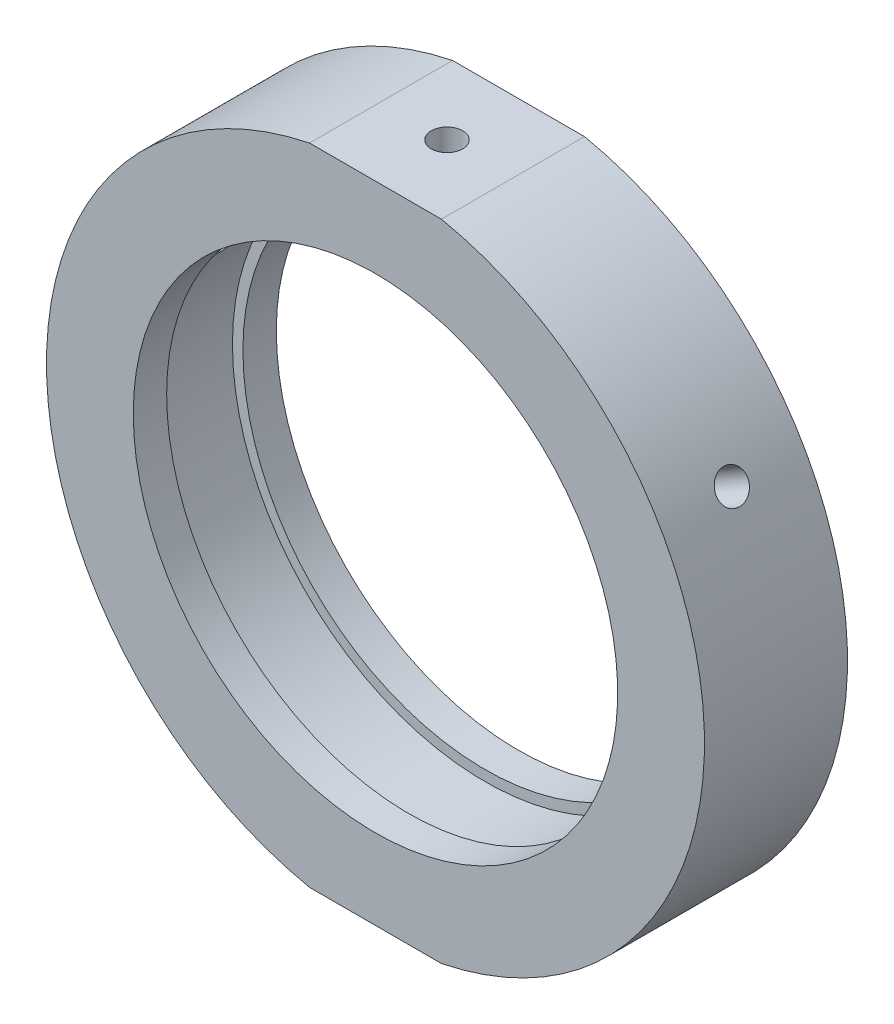
ISO-10303-21;
HEADER;
FILE_DESCRIPTION(('STEP AP214'),'2;1');
FILE_NAME('part.step','',(''),(''),'','','');
FILE_SCHEMA(('AUTOMOTIVE_DESIGN { 1 0 10303 214 1 1 1 1 }'));
ENDSEC;
DATA;
#1=APPLICATION_CONTEXT('core data for automotive mechanical design processes');
#2=APPLICATION_PROTOCOL_DEFINITION('international standard','automotive_design',2000,#1);
#3=PRODUCT_CONTEXT('',#1,'mechanical');
#4=PRODUCT('Part','Part','',(#3));
#5=PRODUCT_RELATED_PRODUCT_CATEGORY('part','',(#4));
#6=PRODUCT_DEFINITION_FORMATION('','',#4);
#7=PRODUCT_DEFINITION_CONTEXT('part definition',#1,'design');
#8=PRODUCT_DEFINITION('design','',#6,#7);
#9=PRODUCT_DEFINITION_SHAPE('','',#8);
#10=(LENGTH_UNIT() NAMED_UNIT(*) SI_UNIT(.MILLI.,.METRE.));
#11=(NAMED_UNIT(*) PLANE_ANGLE_UNIT() SI_UNIT($,.RADIAN.));
#12=(NAMED_UNIT(*) SI_UNIT($,.STERADIAN.) SOLID_ANGLE_UNIT());
#13=UNCERTAINTY_MEASURE_WITH_UNIT(LENGTH_MEASURE(1.E-05),#10,'distance_accuracy_value','');
#14=(GEOMETRIC_REPRESENTATION_CONTEXT(3) GLOBAL_UNCERTAINTY_ASSIGNED_CONTEXT((#13)) GLOBAL_UNIT_ASSIGNED_CONTEXT((#10,
#11,#12)) REPRESENTATION_CONTEXT('',''));
#15=CARTESIAN_POINT('',(0.,0.,0.));
#16=DIRECTION('',(0.,0.,1.));
#17=DIRECTION('',(1.,0.,0.));
#18=AXIS2_PLACEMENT_3D('',#15,#16,#17);
#19=CARTESIAN_POINT('',(0.,0.,-31.9390681003584));
#20=DIRECTION('',(0.,0.,-1.));
#21=DIRECTION('',(-1.,0.,0.));
#22=AXIS2_PLACEMENT_3D('',#19,#20,#21);
#23=CYLINDRICAL_SURFACE('',#22,34.5);
#24=CARTESIAN_POINT('',(29.018686518257,18.659202361171,0.));
#25=CARTESIAN_POINT('',(29.0186890226301,18.6591990847709,-0.0926243427230529));
#26=CARTESIAN_POINT('',(29.0229261660724,18.6526139808489,-0.185314497676535));
#27=CARTESIAN_POINT('',(29.0397421064565,18.6264223952989,-0.368138169659676));
#28=CARTESIAN_POINT('',(29.0523307499622,18.6068005430772,-0.458268537692519));
#29=CARTESIAN_POINT('',(29.0854084283758,18.5550519839002,-0.633297772029714));
#30=CARTESIAN_POINT('',(29.1058934574305,18.5229316173901,-0.718199265666094));
#31=CARTESIAN_POINT('',(29.154053713866,18.4470366758545,-0.880385338206471));
#32=CARTESIAN_POINT('',(29.1817272362996,18.4032648642265,-0.95767171725549));
#33=CARTESIAN_POINT('',(29.2433561506523,18.3051760072346,-1.1025293223219));
#34=CARTESIAN_POINT('',(29.277316671254,18.2508503506647,-1.1700925360107));
#35=CARTESIAN_POINT('',(29.3503804278457,18.1331177240746,-1.29351769255678));
#36=CARTESIAN_POINT('',(29.3894838729624,18.0697103847566,-1.3493791593463));
#37=CARTESIAN_POINT('',(29.4715871030045,17.9354881781567,-1.44783646516307));
#38=CARTESIAN_POINT('',(29.5145886771053,17.8646699070562,-1.4904261724723));
#39=CARTESIAN_POINT('',(29.6031190902553,17.7175816846396,-1.56109160826911));
#40=CARTESIAN_POINT('',(29.648647911373,17.6413117720034,-1.58916743972261));
#41=CARTESIAN_POINT('',(29.740808795372,17.4854932647401,-1.62998728862952));
#42=CARTESIAN_POINT('',(29.7874399787981,17.4059472484999,-1.6427431335627));
#43=CARTESIAN_POINT('',(29.8804691897067,17.2457571173625,-1.65259741342718));
#44=CARTESIAN_POINT('',(29.9268672189013,17.1651130105453,-1.6496959635067));
#45=CARTESIAN_POINT('',(30.018083628711,17.0050913768857,-1.62832784342119));
#46=CARTESIAN_POINT('',(30.0629032703104,16.9257128680339,-1.60987390628149));
#47=CARTESIAN_POINT('',(30.1497956002202,16.770442620803,-1.557944385443));
#48=CARTESIAN_POINT('',(30.1918682777349,16.6945508961276,-1.52446874271179));
#49=CARTESIAN_POINT('',(30.2722021813879,16.5484360864251,-1.44343152976842));
#50=CARTESIAN_POINT('',(30.3104618277835,16.4782153531619,-1.39586415349125));
#51=CARTESIAN_POINT('',(30.3822123637559,16.3455458494187,-1.28799798254371));
#52=CARTESIAN_POINT('',(30.4157032226793,16.2830971288969,-1.22769910604258));
#53=CARTESIAN_POINT('',(30.4771623434601,16.1677722457299,-1.09600960458675));
#54=CARTESIAN_POINT('',(30.5051250414628,16.114905731566,-1.02460793293809));
#55=CARTESIAN_POINT('',(30.5548550638342,16.0204148604137,-0.872778498215204));
#56=CARTESIAN_POINT('',(30.5766223866588,15.9787905062275,-0.792350732891145));
#57=CARTESIAN_POINT('',(30.6134867225159,15.9080492118723,-0.624745495457385));
#58=CARTESIAN_POINT('',(30.6285835419517,15.8789326347149,-0.537567827532799));
#59=CARTESIAN_POINT('',(30.6517835414348,15.8341026999537,-0.358940446729577));
#60=CARTESIAN_POINT('',(30.6598867696106,15.8183892501122,-0.26749076325471));
#61=CARTESIAN_POINT('',(30.6689247152818,15.8008593470062,-0.0830122772694559));
#62=CARTESIAN_POINT('',(30.6698665258734,15.7990291429491,0.0100148712465103));
#63=CARTESIAN_POINT('',(30.664580676854,15.8092860027456,0.195092849541695));
#64=CARTESIAN_POINT('',(30.658353038901,15.821373024557,0.287143682269392));
#65=CARTESIAN_POINT('',(30.6388634170433,15.8590823818547,0.467612670778402));
#66=CARTESIAN_POINT('',(30.6256046953998,15.8846984401569,0.556032490783882));
#67=CARTESIAN_POINT('',(30.5923358095992,15.9486765040332,0.726780786594247));
#68=CARTESIAN_POINT('',(30.5723256097426,15.987038577004,0.809109230187154));
#69=CARTESIAN_POINT('',(30.5259682580852,16.0753769032314,0.965408887343573));
#70=CARTESIAN_POINT('',(30.4996161301641,16.1253622755297,1.03937347098153));
#71=CARTESIAN_POINT('',(30.4411712398855,16.2354231711368,1.17677914740038));
#72=CARTESIAN_POINT('',(30.4090784437665,16.2954987537871,1.24022017828687));
#73=CARTESIAN_POINT('',(30.3398679677335,16.4239986427153,1.35482978227289));
#74=CARTESIAN_POINT('',(30.3027462394544,16.4924296708247,1.40598837488637));
#75=CARTESIAN_POINT('',(30.2243987545537,16.6355753834692,1.494512673378));
#76=CARTESIAN_POINT('',(30.183173014658,16.7102900423948,1.53187843546654));
#77=CARTESIAN_POINT('',(30.0976849159111,16.8637798205434,1.59173893309679));
#78=CARTESIAN_POINT('',(30.0534238720324,16.9425531778004,1.61424006401769));
#79=CARTESIAN_POINT('',(29.963030084702,17.1019067894185,1.64375352134684));
#80=CARTESIAN_POINT('',(29.9168973506251,17.1824870347285,1.65076592532463));
#81=CARTESIAN_POINT('',(29.8240946146471,17.3430669653615,1.64910212014318));
#82=CARTESIAN_POINT('',(29.7774251953544,17.4230671501364,1.640441572862));
#83=CARTESIAN_POINT('',(29.6848591764854,17.5803146476675,1.6077100652785));
#84=CARTESIAN_POINT('',(29.638962578377,17.6575619551951,1.5836390757076));
#85=CARTESIAN_POINT('',(29.5493252013585,17.8071612173229,1.52077310447278));
#86=CARTESIAN_POINT('',(29.5055844419095,17.8795131277338,1.48197798991912));
#87=CARTESIAN_POINT('',(29.4216223362801,18.017343299041,1.39076788234282));
#88=CARTESIAN_POINT('',(29.3814008795705,18.0828217758211,1.33835331726557));
#89=CARTESIAN_POINT('',(29.3057307454963,18.2052007887114,1.22133661715551));
#90=CARTESIAN_POINT('',(29.2702863485369,18.2620936372031,1.15672367477513));
#91=CARTESIAN_POINT('',(29.2053717797418,18.3657292092485,1.01714936462466));
#92=CARTESIAN_POINT('',(29.1759030811655,18.4124694299568,0.942185452546655));
#93=CARTESIAN_POINT('',(29.1239205894126,18.4945835544808,0.783982153805299));
#94=CARTESIAN_POINT('',(29.1014132049216,18.5299469858563,0.700735234302688));
#95=CARTESIAN_POINT('',(29.0641845622712,18.5882862214062,0.528445560311791));
#96=CARTESIAN_POINT('',(29.0494540958738,18.6112766763966,0.439409801080956));
#97=CARTESIAN_POINT('',(29.0321614740973,18.6382333601077,0.291516338342964));
#98=CARTESIAN_POINT('',(29.0271160082175,18.6460874105114,0.233616851804285));
#99=CARTESIAN_POINT('',(29.0203777395267,18.6565729452599,0.117153687562115));
#100=CARTESIAN_POINT('',(29.0186849341027,18.659204433675,0.0585900103763134));
#101=CARTESIAN_POINT('',(29.018686518257,18.659202361171,0.));
#102=B_SPLINE_CURVE_WITH_KNOTS('',3,(#24,#25,#26,#27,#28,#29,#30,#31,#32,#33,#34,#35,#36,#37,
#38,#39,#40,#41,#42,#43,#44,#45,#46,#47,#48,#49,#50,#51,#52,#53,#54,#55,#56,#57,#58,#59,#60,#61,
#62,#63,#64,#65,#66,#67,#68,#69,#70,#71,#72,#73,#74,#75,#76,#77,#78,#79,#80,#81,#82,#83,#84,#85,
#86,#87,#88,#89,#90,#91,#92,#93,#94,#95,#96,#97,#98,#99,#100,#101),.UNSPECIFIED.,.T.,.F.,(4,2,2,
2,2,2,2,2,2,2,2,2,2,2,2,2,2,2,2,2,2,2,2,2,2,2,2,2,2,2,2,2,2,2,2,2,2,2,4),(0.,0.277659154077304,
0.555646256308949,0.833492520289484,1.11127294552115,1.38928097954157,1.66730032169979,
1.94544792246327,2.22359354993491,2.50152430248859,2.77945301106291,3.05715439655709,
3.33485687337424,3.61267392845925,3.89049276924681,4.16858981490657,4.44668692988451,
4.72479211549335,5.00289538721968,5.28072317291097,5.55855011932173,5.83624827305819,
6.11394789519312,6.3918661256273,6.6697859905833,6.94793092956791,7.22607473500655,
7.50409879340256,7.78212145941516,8.05986645258555,8.33761197326969,8.61536000075172,
8.89309930199183,9.17108583548282,9.44914082116977,9.72745103152107,10.0054309661759,
10.1810658470197,10.3567005909779),.UNSPECIFIED.);
#103=CARTESIAN_POINT('',(29.018686518257,18.659202361171,0.));
#104=VERTEX_POINT('',#103);
#105=EDGE_CURVE('E11',#104,#104,#102,.T.);
#106=ORIENTED_EDGE('',*,*,#105,.T.);
#107=EDGE_LOOP('',(#106));
#108=FACE_BOUND('',#107,.T.);
#109=CARTESIAN_POINT('',(0.,0.,7.50000000000001));
#110=DIRECTION('',(0.,0.,-1.));
#111=DIRECTION('',(-1.,0.,0.));
#112=AXIS2_PLACEMENT_3D('',#109,#110,#111);
#113=CIRCLE('',#112,34.5);
#114=CARTESIAN_POINT('',(6.91447756522504,33.8,7.5));
#115=VERTEX_POINT('',#114);
#116=CARTESIAN_POINT('',(6.91447756522504,-33.8,7.50000000000001));
#117=VERTEX_POINT('',#116);
#118=EDGE_CURVE('E146',#115,#117,#113,.T.);
#119=ORIENTED_EDGE('',*,*,#118,.T.);
#120=DIRECTION('',(0.,0.,-1.));
#121=VECTOR('',#120,1.);
#122=CARTESIAN_POINT('',(6.9144775652251,-33.8,-31.9390681003584));
#123=LINE('',#122,#121);
#124=CARTESIAN_POINT('',(6.91447756522509,-33.8,-7.5));
#125=VERTEX_POINT('',#124);
#126=EDGE_CURVE('E59',#117,#125,#123,.T.);
#127=ORIENTED_EDGE('',*,*,#126,.T.);
#128=CARTESIAN_POINT('',(0.,0.,-7.5));
#129=DIRECTION('',(0.,0.,-1.));
#130=DIRECTION('',(-1.,0.,0.));
#131=AXIS2_PLACEMENT_3D('',#128,#129,#130);
#132=CIRCLE('',#131,34.5);
#133=CARTESIAN_POINT('',(6.9144775652251,33.8,-7.49999999999999));
#134=VERTEX_POINT('',#133);
#135=EDGE_CURVE('E150',#134,#125,#132,.T.);
#136=ORIENTED_EDGE('',*,*,#135,.F.);
#137=DIRECTION('',(0.,0.,-1.));
#138=VECTOR('',#137,1.);
#139=CARTESIAN_POINT('',(6.9144775652251,33.8,-31.9390681003584));
#140=LINE('',#139,#138);
#141=EDGE_CURVE('E120',#134,#115,#140,.F.);
#142=ORIENTED_EDGE('',*,*,#141,.T.);
#143=EDGE_LOOP('',(#119,#127,#136,#142));
#144=FACE_BOUND('',#143,.T.);
#145=ADVANCED_FACE('F39',(#108,#144),#23,.T.);
#146=CARTESIAN_POINT('',(25.4,0.,-7.5));
#147=DIRECTION('',(0.,0.,1.));
#148=DIRECTION('',(1.,0.,0.));
#149=AXIS2_PLACEMENT_3D('',#146,#147,#148);
#150=PLANE('',#149);
#151=CARTESIAN_POINT('',(0.,0.,-7.5));
#152=DIRECTION('',(0.,0.,-1.));
#153=DIRECTION('',(-1.,0.,0.));
#154=AXIS2_PLACEMENT_3D('',#151,#152,#153);
#155=CIRCLE('',#154,25.4);
#156=CARTESIAN_POINT('',(-25.4,0.,-7.5));
#157=VERTEX_POINT('',#156);
#158=EDGE_CURVE('E128',#157,#157,#155,.T.);
#159=ORIENTED_EDGE('',*,*,#158,.F.);
#160=EDGE_LOOP('',(#159));
#161=FACE_BOUND('',#160,.T.);
#162=ORIENTED_EDGE('',*,*,#135,.T.);
#163=DIRECTION('',(-1.,0.,0.));
#164=VECTOR('',#163,1.);
#165=CARTESIAN_POINT('',(25.4,-33.8,-7.5));
#166=LINE('',#165,#164);
#167=CARTESIAN_POINT('',(-6.9144775652251,-33.8,-7.49999999999999));
#168=VERTEX_POINT('',#167);
#169=EDGE_CURVE('E116',#125,#168,#166,.T.);
#170=ORIENTED_EDGE('',*,*,#169,.T.);
#171=CARTESIAN_POINT('',(-6.91447756522508,33.8,-7.5));
#172=VERTEX_POINT('',#171);
#173=EDGE_CURVE('E149',#168,#172,#132,.T.);
#174=ORIENTED_EDGE('',*,*,#173,.T.);
#175=DIRECTION('',(1.,0.,0.));
#176=VECTOR('',#175,1.);
#177=CARTESIAN_POINT('',(25.4,33.8,-7.5));
#178=LINE('',#177,#176);
#179=EDGE_CURVE('E123',#172,#134,#178,.T.);
#180=ORIENTED_EDGE('',*,*,#179,.T.);
#181=EDGE_LOOP('',(#162,#170,#174,#180));
#182=FACE_BOUND('',#181,.T.);
#183=ADVANCED_FACE('F41',(#161,#182),#150,.F.);
#184=CARTESIAN_POINT('',(-30.668686518257,15.8013185286824,0.));
#185=CARTESIAN_POINT('',(-30.6686849329978,15.8013223357332,-0.0926243427230534));
#186=CARTESIAN_POINT('',(-30.665100637436,15.8082843615547,-0.185314497676536));
#187=CARTESIAN_POINT('',(-30.6508260291763,15.8359431858907,-0.368138169659677));
#188=CARTESIAN_POINT('',(-30.6401273284359,15.8566561970768,-0.45826853769252));
#189=CARTESIAN_POINT('',(-30.6118506007862,15.9111765864697,-0.633297772029714));
#190=CARTESIAN_POINT('',(-30.5942760619368,15.9449773252833,-0.718199265666095));
#191=CARTESIAN_POINT('',(-30.5526292427661,16.0246328015771,-0.880385338206472));
#192=CARTESIAN_POINT('',(-30.5285585031433,16.0704846808308,-0.957671717255491));
#193=CARTESIAN_POINT('',(-30.4744255183365,16.1729013147638,-1.1025293223219));
#194=CARTESIAN_POINT('',(-30.4443583799706,16.2294748166156,-1.1700925360107));
#195=CARTESIAN_POINT('',(-30.3789308127852,16.3516161992149,-1.29351769255678));
#196=CARTESIAN_POINT('',(-30.3435701687077,16.4171844457205,-1.3493791593463));
#197=CARTESIAN_POINT('',(-30.2683819430613,16.5553990319696,-1.44783646516308));
#198=CARTESIAN_POINT('',(-30.2285523082866,16.6280486230939,-1.4904261724723));
#199=CARTESIAN_POINT('',(-30.1454353776513,16.7782623210977,-1.56109160826912));
#200=CARTESIAN_POINT('',(-30.1021481063228,16.855826393108,-1.58916743972261));
#201=CARTESIAN_POINT('',(-30.0132857626524,17.013549313518,-1.62998728862952));
#202=CARTESIAN_POINT('',(-29.9677124835316,17.0937061110937,-1.6427431335627));
#203=CARTESIAN_POINT('',(-29.8754983659854,17.2543668366032,-1.65259741342718));
#204=CARTESIAN_POINT('',(-29.8288575354135,17.3348707619799,-1.6496959635067));
#205=CARTESIAN_POINT('',(-29.735882940414,17.493877306947,-1.62832784342119));
#206=CARTESIAN_POINT('',(-29.6895489560336,17.5723815095864,-1.60987390628149));
#207=CARTESIAN_POINT('',(-29.5985271424346,17.7252675982977,-1.557944385443));
#208=CARTESIAN_POINT('',(-29.553839319686,17.7996494681684,-1.52446874271179));
#209=CARTESIAN_POINT('',(-29.4674671344411,17.9422780743683,-1.44343152976842));
#210=CARTESIAN_POINT('',(-29.4257840187606,18.0105222667184,-1.39586415349125));
#211=CARTESIAN_POINT('',(-29.3467641261977,18.1389948054771,-1.28799798254371));
#212=CARTESIAN_POINT('',(-29.3094273772537,18.1992231003603,-1.22769910604258));
#213=CARTESIAN_POINT('',(-29.2402826591329,18.3101107018343,-1.09600960458675));
#214=CARTESIAN_POINT('',(-29.2084802638588,18.3607603657449,-1.02460793293809));
#215=CARTESIAN_POINT('',(-29.151513780201,18.4510732640255,-0.872778498215202));
#216=CARTESIAN_POINT('',(-29.1263496934718,18.490736495657,-0.792350732891143));
#217=CARTESIAN_POINT('',(-29.0835181033921,18.5580325941805,-0.624745495457382));
#218=CARTESIAN_POINT('',(-29.0658508176205,18.585665111907,-0.537567827532797));
#219=CARTESIAN_POINT('',(-29.0386269550089,18.6281718682077,-0.358940446729574));
#220=CARTESIAN_POINT('',(-29.0290703223529,18.6430461945814,-0.267490763254706));
#221=CARTESIAN_POINT('',(-29.0184079537728,18.6596382366837,-0.0830122772694523));
#222=CARTESIAN_POINT('',(-29.0172938558611,18.6613689706101,0.0100148712465135));
#223=CARTESIAN_POINT('',(-29.0235336324983,18.6516628611804,0.195092849541697));
#224=CARTESIAN_POINT('',(-29.0308874814665,18.6402260576018,0.287143682269394));
#225=CARTESIAN_POINT('',(-29.0537999319178,18.6044928713141,0.467612670778404));
#226=CARTESIAN_POINT('',(-29.0693547283306,18.5802024523981,0.556032490783885));
#227=CARTESIAN_POINT('',(-29.1081269140322,18.519401720201,0.72678078659425));
#228=CARTESIAN_POINT('',(-29.1313443438384,18.482891342305,0.809109230187156));
#229=CARTESIAN_POINT('',(-29.1846689026504,18.3985755350037,0.965408887343574));
#230=CARTESIAN_POINT('',(-29.2147814409179,18.3507612366312,1.03937347098153));
#231=CARTESIAN_POINT('',(-29.2808745273376,18.245116029125,1.17677914740039));
#232=CARTESIAN_POINT('',(-29.3168551100003,18.1872850610823,1.24022017828687));
#233=CARTESIAN_POINT('',(-29.3935340401792,18.0630970861656,1.35482978227289));
#234=CARTESIAN_POINT('',(-29.4342361847895,17.9967332123888,1.40598837488637));
#235=CARTESIAN_POINT('',(-29.519030265932,17.8573094438199,1.494512673378));
#236=CARTESIAN_POINT('',(-29.5631221886489,17.7842495763177,1.53187843546654));
#237=CARTESIAN_POINT('',(-29.6533041863734,17.6334698220073,1.59173893309679));
#238=CARTESIAN_POINT('',(-29.6993933929599,17.5557519549819,1.61424006401769));
#239=CARTESIAN_POINT('',(-29.7922007751408,17.3977918330003,1.64375352134684));
#240=CARTESIAN_POINT('',(-29.838918947584,17.3175495906887,1.65076592532463));
#241=CARTESIAN_POINT('',(-29.9315838788611,17.1568900984746,1.64910212014318));
#242=CARTESIAN_POINT('',(-29.9775313615373,17.0764731033998,1.640441572862));
#243=CARTESIAN_POINT('',(-30.0674286796463,16.9176848307665,1.6077100652785));
#244=CARTESIAN_POINT('',(-30.1113785112849,16.8393135570936,1.5836390757076));
#245=CARTESIAN_POINT('',(-30.1961165841658,16.686885680403,1.52077310447278));
#246=CARTESIAN_POINT('',(-30.2369047968694,16.6128291163339,1.48197798991912));
#247=CARTESIAN_POINT('',(-30.3142881738147,16.47120071425,1.39076788234282));
#248=CARTESIAN_POINT('',(-30.3508834697526,16.4036286725723,1.33835331726557));
#249=CARTESIAN_POINT('',(-30.4190317367686,16.276906907711,1.22133661715551));
#250=CARTESIAN_POINT('',(-30.4505801903763,16.2177647352765,1.15672367477513));
#251=CARTESIAN_POINT('',(-30.5078739441058,16.1097292836016,1.01714936462466));
#252=CARTESIAN_POINT('',(-30.5336178133295,16.0608385316639,0.942185452546655));
#253=CARTESIAN_POINT('',(-30.5787394853004,15.9747633109919,0.783982153805298));
#254=CARTESIAN_POINT('',(-30.5981114229911,15.9375896285622,0.700735234302687));
#255=CARTESIAN_POINT('',(-30.6300203616894,15.8761790605036,0.528445560311791));
#256=CARTESIAN_POINT('',(-30.642565446557,15.8519268748987,0.439409801080956));
#257=CARTESIAN_POINT('',(-30.6572643085643,15.8234726832866,0.291516338342964));
#258=CARTESIAN_POINT('',(-30.6615433827967,15.8151761564589,0.233616851804285));
#259=CARTESIAN_POINT('',(-30.6672549879157,15.8040978772209,0.117153687562115));
#260=CARTESIAN_POINT('',(-30.668687521021,15.8013161205126,0.0585900103763135));
#261=CARTESIAN_POINT('',(-30.668686518257,15.8013185286824,0.));
#262=B_SPLINE_CURVE_WITH_KNOTS('',3,(#184,#185,#186,#187,#188,#189,#190,#191,#192,#193,#194,
#195,#196,#197,#198,#199,#200,#201,#202,#203,#204,#205,#206,#207,#208,#209,#210,#211,#212,#213,
#214,#215,#216,#217,#218,#219,#220,#221,#222,#223,#224,#225,#226,#227,#228,#229,#230,#231,#232,
#233,#234,#235,#236,#237,#238,#239,#240,#241,#242,#243,#244,#245,#246,#247,#248,#249,#250,#251,
#252,#253,#254,#255,#256,#257,#258,#259,#260,#261),.UNSPECIFIED.,.T.,.F.,(4,2,2,2,2,2,2,2,2,2,2,
2,2,2,2,2,2,2,2,2,2,2,2,2,2,2,2,2,2,2,2,2,2,2,2,2,2,2,4),(0.,0.277659154077306,0.55564625630895,
0.833492520289485,1.11127294552115,1.38928097954157,1.6673003216998,1.94544792246328,
2.22359354993491,2.50152430248859,2.77945301106291,3.05715439655709,3.33485687337424,
3.61267392845925,3.89049276924681,4.16858981490657,4.44668692988451,4.72479211549335,
5.00289538721968,5.28072317291098,5.55855011932173,5.83624827305819,6.11394789519312,
6.39186612562731,6.6697859905833,6.94793092956791,7.22607473500655,7.50409879340256,
7.78212145941516,8.05986645258555,8.33761197326969,8.61536000075172,8.89309930199183,
9.17108583548282,9.44914082116977,9.72745103152107,10.0054309661759,10.1810658470197,
10.3567005909779),.UNSPECIFIED.);
#263=CARTESIAN_POINT('',(-30.668686518257,15.8013185286824,0.));
#264=VERTEX_POINT('',#263);
#265=EDGE_CURVE('E174',#264,#264,#262,.T.);
#266=ORIENTED_EDGE('',*,*,#265,.T.);
#267=EDGE_LOOP('',(#266));
#268=FACE_BOUND('',#267,.T.);
#269=ORIENTED_EDGE('',*,*,#173,.F.);
#270=DIRECTION('',(0.,0.,-1.));
#271=VECTOR('',#270,1.);
#272=CARTESIAN_POINT('',(-6.9144775652251,-33.8,-31.9390681003584));
#273=LINE('',#272,#271);
#274=CARTESIAN_POINT('',(-6.91447756522503,-33.8,7.5));
#275=VERTEX_POINT('',#274);
#276=EDGE_CURVE('E114',#168,#275,#273,.F.);
#277=ORIENTED_EDGE('',*,*,#276,.T.);
#278=CARTESIAN_POINT('',(-6.91447756522503,33.8,7.50000000000001));
#279=VERTEX_POINT('',#278);
#280=EDGE_CURVE('E67',#275,#279,#113,.T.);
#281=ORIENTED_EDGE('',*,*,#280,.T.);
#282=DIRECTION('',(0.,0.,-1.));
#283=VECTOR('',#282,1.);
#284=CARTESIAN_POINT('',(-6.9144775652251,33.8,-31.9390681003584));
#285=LINE('',#284,#283);
#286=EDGE_CURVE('E126',#279,#172,#285,.T.);
#287=ORIENTED_EDGE('',*,*,#286,.T.);
#288=EDGE_LOOP('',(#269,#277,#281,#287));
#289=FACE_BOUND('',#288,.T.);
#290=ADVANCED_FACE('F159',(#268,#289),#23,.T.);
#291=CARTESIAN_POINT('',(34.5,0.,7.5));
#292=DIRECTION('',(0.,0.,-1.));
#293=DIRECTION('',(-1.,0.,0.));
#294=AXIS2_PLACEMENT_3D('',#291,#292,#293);
#295=PLANE('',#294);
#296=ORIENTED_EDGE('',*,*,#280,.F.);
#297=DIRECTION('',(1.,0.,0.));
#298=VECTOR('',#297,1.);
#299=CARTESIAN_POINT('',(34.5,-33.8,7.5));
#300=LINE('',#299,#298);
#301=EDGE_CURVE('E52',#275,#117,#300,.T.);
#302=ORIENTED_EDGE('',*,*,#301,.T.);
#303=ORIENTED_EDGE('',*,*,#118,.F.);
#304=DIRECTION('',(-1.,0.,0.));
#305=VECTOR('',#304,1.);
#306=CARTESIAN_POINT('',(34.5,33.8,7.5));
#307=LINE('',#306,#305);
#308=EDGE_CURVE('E153',#115,#279,#307,.T.);
#309=ORIENTED_EDGE('',*,*,#308,.T.);
#310=EDGE_LOOP('',(#296,#302,#303,#309));
#311=FACE_BOUND('',#310,.T.);
#312=CARTESIAN_POINT('',(0.,0.,7.5));
#313=DIRECTION('',(0.,0.,-1.));
#314=DIRECTION('',(-1.,0.,0.));
#315=AXIS2_PLACEMENT_3D('',#312,#313,#314);
#316=CIRCLE('',#315,25.4);
#317=CARTESIAN_POINT('',(-25.4,0.,7.5));
#318=VERTEX_POINT('',#317);
#319=EDGE_CURVE('E143',#318,#318,#316,.T.);
#320=ORIENTED_EDGE('',*,*,#319,.T.);
#321=EDGE_LOOP('',(#320));
#322=FACE_BOUND('',#321,.T.);
#323=ADVANCED_FACE('F192',(#311,#322),#295,.F.);
#324=CARTESIAN_POINT('',(0.,0.,-31.9390681003584));
#325=DIRECTION('',(0.,0.,-1.));
#326=DIRECTION('',(-1.,0.,0.));
#327=AXIS2_PLACEMENT_3D('',#324,#325,#326);
#328=CYLINDRICAL_SURFACE('',#327,25.4);
#329=ORIENTED_EDGE('',*,*,#319,.F.);
#330=EDGE_LOOP('',(#329));
#331=FACE_BOUND('',#330,.T.);
#332=CARTESIAN_POINT('',(0.,0.,4.));
#333=DIRECTION('',(0.,0.,-1.));
#334=DIRECTION('',(-1.,0.,0.));
#335=AXIS2_PLACEMENT_3D('',#332,#333,#334);
#336=CIRCLE('',#335,25.4);
#337=CARTESIAN_POINT('',(-25.4,0.,4.));
#338=VERTEX_POINT('',#337);
#339=EDGE_CURVE('E140',#338,#338,#336,.T.);
#340=ORIENTED_EDGE('',*,*,#339,.T.);
#341=EDGE_LOOP('',(#340));
#342=FACE_BOUND('',#341,.T.);
#343=ADVANCED_FACE('F189',(#331,#342),#328,.F.);
#344=CARTESIAN_POINT('',(25.4,0.,4.));
#345=DIRECTION('',(0.,0.,1.));
#346=DIRECTION('',(1.,0.,0.));
#347=AXIS2_PLACEMENT_3D('',#344,#345,#346);
#348=PLANE('',#347);
#349=ORIENTED_EDGE('',*,*,#339,.F.);
#350=EDGE_LOOP('',(#349));
#351=FACE_BOUND('',#350,.T.);
#352=CARTESIAN_POINT('',(0.,0.,4.));
#353=DIRECTION('',(0.,0.,-1.));
#354=DIRECTION('',(-1.,0.,0.));
#355=AXIS2_PLACEMENT_3D('',#352,#353,#354);
#356=CIRCLE('',#355,26.5);
#357=CARTESIAN_POINT('',(-26.5,0.,4.));
#358=VERTEX_POINT('',#357);
#359=EDGE_CURVE('E137',#358,#358,#356,.T.);
#360=ORIENTED_EDGE('',*,*,#359,.T.);
#361=EDGE_LOOP('',(#360));
#362=FACE_BOUND('',#361,.T.);
#363=ADVANCED_FACE('F183',(#351,#362),#348,.F.);
#364=CARTESIAN_POINT('',(0.,0.,-31.9390681003584));
#365=DIRECTION('',(0.,0.,-1.));
#366=DIRECTION('',(-1.,0.,0.));
#367=AXIS2_PLACEMENT_3D('',#364,#365,#366);
#368=CYLINDRICAL_SURFACE('',#367,26.5);
#369=CARTESIAN_POINT('',(-23.7301440728933,11.7953491800679,0.));
#370=CARTESIAN_POINT('',(-23.7301426315556,11.7953530523703,0.092584794291166));
#371=CARTESIAN_POINT('',(-23.7266601850363,11.8023662019752,0.185234434036178));
#372=CARTESIAN_POINT('',(-23.7127829671561,11.8302221765848,0.367975476334141));
#373=CARTESIAN_POINT('',(-23.7023801480403,11.8510811028887,0.458063772945838));
#374=CARTESIAN_POINT('',(-23.6748577267139,11.9059669326837,0.633008646244693));
#375=CARTESIAN_POINT('',(-23.6577416673841,11.9399868903737,0.717867955216654));
#376=CARTESIAN_POINT('',(-23.6171248265298,12.0201257551922,0.879978001386831));
#377=CARTESIAN_POINT('',(-23.593625507895,12.0662418900844,0.957230476368432));
#378=CARTESIAN_POINT('',(-23.5406732430841,12.1692255333633,1.10207147063524));
#379=CARTESIAN_POINT('',(-23.5112125003349,12.226107114835,1.16964713451791));
#380=CARTESIAN_POINT('',(-23.4469742856686,12.3488535927227,1.29310627919576));
#381=CARTESIAN_POINT('',(-23.4121965921936,12.414718863478,1.34898927252584));
#382=CARTESIAN_POINT('',(-23.3380723141613,12.5535080894395,1.44751591371275));
#383=CARTESIAN_POINT('',(-23.2987221137364,12.6264376232677,1.49014898449409));
#384=CARTESIAN_POINT('',(-23.2164163184041,12.7771427669188,1.56089784694351));
#385=CARTESIAN_POINT('',(-23.1734607618567,12.8549183251792,1.58901379304684));
#386=CARTESIAN_POINT('',(-23.0851004064078,13.0129288729823,1.62989479118302));
#387=CARTESIAN_POINT('',(-23.0396988875959,13.0931605094179,1.64267989191114));
#388=CARTESIAN_POINT('',(-22.9476290832938,13.2538633471374,1.65259818878884));
#389=CARTESIAN_POINT('',(-22.9009608119979,13.3343345457279,1.64973156024638));
#390=CARTESIAN_POINT('',(-22.8077641476428,13.4931227056173,1.62844431441806));
#391=CARTESIAN_POINT('',(-22.7612356503593,13.5714424986272,1.61004526468086));
#392=CARTESIAN_POINT('',(-22.6696546839537,13.7238721805026,1.55824892569699));
#393=CARTESIAN_POINT('',(-22.6246022235062,13.7979820446288,1.52485154832424));
#394=CARTESIAN_POINT('',(-22.5373586689691,13.9400295705033,1.44398215830166));
#395=CARTESIAN_POINT('',(-22.495169587228,14.0079629026162,1.39650037061728));
#396=CARTESIAN_POINT('',(-22.4150636715141,14.1357921533411,1.28881710743124));
#397=CARTESIAN_POINT('',(-22.3771468852504,14.195687982199,1.22861548990751));
#398=CARTESIAN_POINT('',(-22.3068044837855,14.3059696905885,1.09707965852733));
#399=CARTESIAN_POINT('',(-22.2743882968895,14.3563392582196,1.02572672486742));
#400=CARTESIAN_POINT('',(-22.2162551565766,14.4461371128321,0.87397929945473));
#401=CARTESIAN_POINT('',(-22.1905382058045,14.4855653954942,0.793584804132692));
#402=CARTESIAN_POINT('',(-22.1467214540453,14.5524683853247,0.626024399450548));
#403=CARTESIAN_POINT('',(-22.128622078978,14.5799424241009,0.538858111783452));
#404=CARTESIAN_POINT('',(-22.1007034178629,14.6222281477467,0.36023393898428));
#405=CARTESIAN_POINT('',(-22.0908840351472,14.6370399804462,0.268776103968693));
#406=CARTESIAN_POINT('',(-22.0798976561406,14.6536077552007,0.0843293304343459));
#407=CARTESIAN_POINT('',(-22.078716165179,14.6553855687891,-0.00865678060556204));
#408=CARTESIAN_POINT('',(-22.085011052429,14.6458976499179,-0.193665030605216));
#409=CARTESIAN_POINT('',(-22.0924873859348,14.6346319848099,-0.285687174540047));
#410=CARTESIAN_POINT('',(-22.1158120738629,14.5993595127735,-0.466081269376435));
#411=CARTESIAN_POINT('',(-22.1316537946875,14.5753628012591,-0.554456052784432));
#412=CARTESIAN_POINT('',(-22.1711272970583,14.5152471536344,-0.7251342116466));
#413=CARTESIAN_POINT('',(-22.1947591487193,14.4791281084173,-0.807437532446505));
#414=CARTESIAN_POINT('',(-22.2490032692352,14.395635650197,-0.963756774418121));
#415=CARTESIAN_POINT('',(-22.2796247907633,14.3482473158054,-1.03776151482472));
#416=CARTESIAN_POINT('',(-22.3467583289334,14.2434635399753,-1.17527024430645));
#417=CARTESIAN_POINT('',(-22.3832704028358,14.1860680012593,-1.23877413129365));
#418=CARTESIAN_POINT('',(-22.4609956798557,14.0626806345092,-1.3535669594302));
#419=CARTESIAN_POINT('',(-22.5022152894159,13.9966770741436,-1.40483895421077));
#420=CARTESIAN_POINT('',(-22.5879512261451,13.8578895820082,-1.49359661128041));
#421=CARTESIAN_POINT('',(-22.6324675331025,13.7851056918069,-1.53108235808247));
#422=CARTESIAN_POINT('',(-22.723343035635,13.6347857679719,-1.59117395772098));
#423=CARTESIAN_POINT('',(-22.7697008769134,13.557253204665,-1.61379053838447));
#424=CARTESIAN_POINT('',(-22.8628702689887,13.3995353765926,-1.64353691282088));
#425=CARTESIAN_POINT('',(-22.9096818153571,13.3193501377005,-1.65066685760017));
#426=CARTESIAN_POINT('',(-23.0023133002366,13.1587295609621,-1.64923610076408));
#427=CARTESIAN_POINT('',(-23.0481347822393,13.078294875659,-1.64070192178827));
#428=CARTESIAN_POINT('',(-23.1376056669382,12.9193469243502,-1.60824015821129));
#429=CARTESIAN_POINT('',(-23.1812550658089,12.8408336617286,-1.5843125465011));
#430=CARTESIAN_POINT('',(-23.2652506332778,12.6880148893639,-1.52174910253589));
#431=CARTESIAN_POINT('',(-23.3055968241629,12.6137093512321,-1.48311336952718));
#432=CARTESIAN_POINT('',(-23.3820073356233,12.471497800057,-1.39223412672861));
#433=CARTESIAN_POINT('',(-23.4180717676544,12.4035916204455,-1.33999097125807));
#434=CARTESIAN_POINT('',(-23.4851556451101,12.276101617329,-1.22328196958489));
#435=CARTESIAN_POINT('',(-23.5161670427244,12.2165310906591,-1.15879697303644));
#436=CARTESIAN_POINT('',(-23.5724206276007,12.107632023832,-1.0194600512231));
#437=CARTESIAN_POINT('',(-23.5976614009239,12.058305994088,-0.944605592395893));
#438=CARTESIAN_POINT('',(-23.641880226511,11.9713778751013,-0.786569577280317));
#439=CARTESIAN_POINT('',(-23.6608505041558,11.9337903432686,-0.703377849058646));
#440=CARTESIAN_POINT('',(-23.6921006658619,11.8716295340132,-0.531163071026291));
#441=CARTESIAN_POINT('',(-23.7043883877379,11.8470410113032,-0.442146990408104));
#442=CARTESIAN_POINT('',(-23.7188548568036,11.8180401128949,-0.293821780690322));
#443=CARTESIAN_POINT('',(-23.723084457187,11.8095429473751,-0.235471469666115));
#444=CARTESIAN_POINT('',(-23.72872952299,11.7981962498272,-0.118089566805454));
#445=CARTESIAN_POINT('',(-23.7301449922935,11.7953467100042,-0.0590579759094216));
#446=CARTESIAN_POINT('',(-23.7301440728933,11.7953491800679,0.));
#447=B_SPLINE_CURVE_WITH_KNOTS('',3,(#369,#370,#371,#372,#373,#374,#375,#376,#377,#378,#379,
#380,#381,#382,#383,#384,#385,#386,#387,#388,#389,#390,#391,#392,#393,#394,#395,#396,#397,#398,
#399,#400,#401,#402,#403,#404,#405,#406,#407,#408,#409,#410,#411,#412,#413,#414,#415,#416,#417,
#418,#419,#420,#421,#422,#423,#424,#425,#426,#427,#428,#429,#430,#431,#432,#433,#434,#435,#436,
#437,#438,#439,#440,#441,#442,#443,#444,#445,#446),.UNSPECIFIED.,.T.,.F.,(4,2,2,2,2,2,2,2,2,2,2,
2,2,2,2,2,2,2,2,2,2,2,2,2,2,2,2,2,2,2,2,2,2,2,2,2,2,2,4),(0.,0.277538784680574,
0.555400886890087,0.83311654557336,1.11076861211985,1.3887861770262,1.66681533012118,
1.945065860092,2.22331342993284,2.50119672724163,2.77907691211105,3.05657187980646,
3.33406847800806,3.61175812020915,3.8894508630918,4.16761487994957,4.44577900661577,
4.72395868414411,5.00213511391118,5.2798446469735,5.55755274605552,5.83504095771686,
6.11253166697478,6.39039186090514,6.66825475599717,6.94650040233515,7.22474434293229,
7.50278731475134,7.78082757542991,8.05839748998988,8.33596789337317,8.61353642382184,
8.89109772747494,9.16909686241464,9.44716404085243,9.72557470526542,10.0036581201335,
10.1806947664638,10.3577311684462),.UNSPECIFIED.);
#448=CARTESIAN_POINT('',(-23.7301440728933,11.7953491800679,0.));
#449=VERTEX_POINT('',#448);
#450=EDGE_CURVE('E43',#449,#449,#447,.T.);
#451=ORIENTED_EDGE('',*,*,#450,.T.);
#452=EDGE_LOOP('',(#451));
#453=FACE_BOUND('',#452,.T.);
#454=CARTESIAN_POINT('',(22.0801440728933,14.6532330125565,0.));
#455=CARTESIAN_POINT('',(22.0801467057366,14.6532298281703,0.0925847942911662));
#456=CARTESIAN_POINT('',(22.0844790481953,14.6467073662148,0.185234434036178));
#457=CARTESIAN_POINT('',(22.1016644209144,14.620761355692,0.367975476334141));
#458=CARTESIAN_POINT('',(22.1145273714313,14.6013227869147,0.458063772945838));
#459=CARTESIAN_POINT('',(22.1482986836784,14.5500447559749,0.633008646244694));
#460=CARTESIAN_POINT('',(22.1692028016087,14.5182118349376,0.717867955216654));
#461=CARTESIAN_POINT('',(22.2182966739448,14.4429671865271,0.879978001386832));
#462=CARTESIAN_POINT('',(22.2464847589684,14.3995581121716,0.957230476368432));
#463=CARTESIAN_POINT('',(22.3091950778168,14.302208284018,1.10207147063524));
#464=CARTESIAN_POINT('',(22.3437256010041,14.248253741647,1.16964713451791));
#465=CARTESIAN_POINT('',(22.4179080617468,14.1312485769084,1.29310627919576));
#466=CARTESIAN_POINT('',(22.4575602127105,14.0681975754963,1.34898927252584));
#467=CARTESIAN_POINT('',(22.5406930691486,13.9346094547024,1.44751591371275));
#468=CARTESIAN_POINT('',(22.5841767979175,13.8640664145763,1.49014898449409));
#469=CARTESIAN_POINT('',(22.6735383831342,13.7174349331143,1.56089784694351));
#470=CARTESIAN_POINT('',(22.7194162141075,13.6413465507804,1.58901379304684));
#471=CARTESIAN_POINT('',(22.8120771848465,13.4858189643727,1.62989479118302));
#472=CARTESIAN_POINT('',(22.858859060781,13.4063842774934,1.64267989191114));
#473=CARTESIAN_POINT('',(22.9519968985552,13.2462980691866,1.65259818878883));
#474=CARTESIAN_POINT('',(22.9983528651596,13.1656465613983,1.64973156024638));
#475=CARTESIAN_POINT('',(23.0892691132665,13.0055418025742,1.62844431441806));
#476=CARTESIAN_POINT('',(23.1338317949904,12.9260870454218,1.61004526468086));
#477=CARTESIAN_POINT('',(23.2200492885825,12.7705607610737,1.55824892569699));
#478=CARTESIAN_POINT('',(23.261704083363,12.6944892537601,1.52485154832424));
#479=CARTESIAN_POINT('',(23.3410990720466,12.5479103562772,1.44398215830166));
#480=CARTESIAN_POINT('',(23.3788365225495,12.4774068736707,1.39650037061728));
#481=CARTESIAN_POINT('',(23.4494869431671,12.3441184903065,1.28881710743124));
#482=CARTESIAN_POINT('',(23.4823998594069,12.2813336757434,1.22861548990751));
#483=CARTESIAN_POINT('',(23.5427354197125,12.1652745149169,1.09707965852732));
#484=CARTESIAN_POINT('',(23.5701486514107,12.1120164897555,1.02572672486742));
#485=CARTESIAN_POINT('',(23.618849304554,12.0167727861366,0.873979299454729));
#486=CARTESIAN_POINT('',(23.6401367235809,11.9747871121289,0.793584804132692));
#487=CARTESIAN_POINT('',(23.6761680364836,11.9033891970789,0.626024399450547));
#488=CARTESIAN_POINT('',(23.6909115644747,11.8739776590899,0.538858111783452));
#489=CARTESIAN_POINT('',(23.7135727448119,11.8286565275017,0.360233938984279));
#490=CARTESIAN_POINT('',(23.7214904768484,11.8127467762707,0.268776103968693));
#491=CARTESIAN_POINT('',(23.7303454011667,11.7949484055781,0.0843293304343457));
#492=CARTESIAN_POINT('',(23.7312942874166,11.7930362975968,-0.00865678060556217));
#493=CARTESIAN_POINT('',(23.72622495227,11.8032317893049,-0.193665030605216));
#494=CARTESIAN_POINT('',(23.7202067668489,11.8153393166021,-0.285687174540047));
#495=CARTESIAN_POINT('',(23.7013222539752,11.8531753249014,-0.466081269376435));
#496=CARTESIAN_POINT('',(23.6884613526087,11.8788930133324,-0.554456052784433));
#497=CARTESIAN_POINT('',(23.6561364257862,11.9431358929741,-0.725134211646601));
#498=CARTESIAN_POINT('',(23.6366723408982,11.9816611994596,-0.807437532446504));
#499=CARTESIAN_POINT('',(23.591487811313,12.0703842149424,-0.963756774418121));
#500=CARTESIAN_POINT('',(23.5657590706509,12.1205973976841,-1.03776151482472));
#501=CARTESIAN_POINT('',(23.5085804279627,12.2311286351004,-1.17527024430645));
#502=CARTESIAN_POINT('',(23.4771304703219,12.2914467880027,-1.23877413129365));
#503=CARTESIAN_POINT('',(23.4091365147202,12.4204525357932,-1.3535669594302));
#504=CARTESIAN_POINT('',(23.3725855594835,12.4891515449892,-1.40483895421077));
#505=CARTESIAN_POINT('',(23.2952600339313,12.6327947902816,-1.49359661128041));
#506=CARTESIAN_POINT('',(23.2544854895094,12.7077389880901,-1.53108235808247));
#507=CARTESIAN_POINT('',(23.1697423680395,12.8615994437824,-1.59117395772098));
#508=CARTESIAN_POINT('',(23.1257761192345,12.9405127936476,-1.61379053838447));
#509=CARTESIAN_POINT('',(23.0357731695317,13.1000587680761,-1.64353691282088));
#510=CARTESIAN_POINT('',(22.9897364888268,13.1806913758676,-1.65066685760017));
#511=CARTESIAN_POINT('',(22.8969507314406,13.3412228833327,-1.64923610076408));
#512=CARTESIAN_POINT('',(22.8502029916241,13.4211227934377,-1.64070192178827));
#513=CARTESIAN_POINT('',(22.7572854702606,13.5780808281404,-1.60824015821129));
#514=CARTESIAN_POINT('',(22.7111156897316,13.6551389477332,-1.5843125465011));
#515=CARTESIAN_POINT('',(22.6207685344231,13.8042906291489,-1.52174910253589));
#516=CARTESIAN_POINT('',(22.5765911462016,13.8763842244672,-1.48311336952717));
#517=CARTESIAN_POINT('',(22.4916375859026,14.0136634440956,-1.39223412672861));
#518=CARTESIAN_POINT('',(22.4508613253007,14.0788492482133,-1.33999097125807));
#519=CARTESIAN_POINT('',(22.373993682601,14.2006905918326,-1.22328196958489));
#520=CARTESIAN_POINT('',(22.3379097919953,14.2573325133084,-1.15879697303644));
#521=CARTESIAN_POINT('',(22.2717272261128,14.3604990802787,-1.0194600512231));
#522=CARTESIAN_POINT('',(22.2416300179482,14.4070212460598,-0.944605592395892));
#523=CARTESIAN_POINT('',(22.188457471396,14.4887799318371,-0.786569577280317));
#524=CARTESIAN_POINT('',(22.1653908527858,14.5240024401107,-0.703377849058646));
#525=CARTESIAN_POINT('',(22.1271830937039,14.5821462786482,-0.531163071026292));
#526=CARTESIAN_POINT('',(22.1120326693334,14.6050820193025,-0.442146990408105));
#527=CARTESIAN_POINT('',(22.0941503891122,14.6321107982206,-0.293821780690323));
#528=CARTESIAN_POINT('',(22.0889064281036,14.6400223223604,-0.235471469666116));
#529=CARTESIAN_POINT('',(22.0819024326795,14.6505844415257,-0.118089566805454));
#530=CARTESIAN_POINT('',(22.0801423934555,14.6532350438124,-0.0590579759094216));
#531=CARTESIAN_POINT('',(22.0801440728933,14.6532330125565,0.));
#532=B_SPLINE_CURVE_WITH_KNOTS('',3,(#454,#455,#456,#457,#458,#459,#460,#461,#462,#463,#464,
#465,#466,#467,#468,#469,#470,#471,#472,#473,#474,#475,#476,#477,#478,#479,#480,#481,#482,#483,
#484,#485,#486,#487,#488,#489,#490,#491,#492,#493,#494,#495,#496,#497,#498,#499,#500,#501,#502,
#503,#504,#505,#506,#507,#508,#509,#510,#511,#512,#513,#514,#515,#516,#517,#518,#519,#520,#521,
#522,#523,#524,#525,#526,#527,#528,#529,#530,#531),.UNSPECIFIED.,.T.,.F.,(4,2,2,2,2,2,2,2,2,2,2,
2,2,2,2,2,2,2,2,2,2,2,2,2,2,2,2,2,2,2,2,2,2,2,2,2,2,2,4),(0.,0.277538784680575,
0.555400886890088,0.833116545573363,1.11076861211985,1.3887861770262,1.66681533012118,
1.945065860092,2.22331342993284,2.50119672724163,2.77907691211105,3.05657187980646,
3.33406847800805,3.61175812020915,3.88945086309181,4.16761487994957,4.44577900661577,
4.72395868414411,5.00213511391118,5.2798446469735,5.55755274605552,5.83504095771686,
6.11253166697478,6.39039186090514,6.66825475599717,6.94650040233515,7.22474434293229,
7.50278731475133,7.7808275754299,8.05839748998988,8.33596789337317,8.61353642382184,
8.89109772747494,9.16909686241464,9.44716404085243,9.72557470526542,10.0036581201335,
10.1806947664638,10.3577311684462),.UNSPECIFIED.);
#533=CARTESIAN_POINT('',(22.0801440728933,14.6532330125565,0.));
#534=VERTEX_POINT('',#533);
#535=EDGE_CURVE('E108',#534,#534,#532,.T.);
#536=ORIENTED_EDGE('',*,*,#535,.T.);
#537=EDGE_LOOP('',(#536));
#538=FACE_BOUND('',#537,.T.);
#539=ORIENTED_EDGE('',*,*,#359,.F.);
#540=EDGE_LOOP('',(#539));
#541=FACE_BOUND('',#540,.T.);
#542=CARTESIAN_POINT('',(0.,0.,-4.));
#543=DIRECTION('',(0.,0.,-1.));
#544=DIRECTION('',(-1.,0.,0.));
#545=AXIS2_PLACEMENT_3D('',#542,#543,#544);
#546=CIRCLE('',#545,26.5);
#547=CARTESIAN_POINT('',(-26.5,0.,-4.));
#548=VERTEX_POINT('',#547);
#549=EDGE_CURVE('E134',#548,#548,#546,.T.);
#550=ORIENTED_EDGE('',*,*,#549,.T.);
#551=EDGE_LOOP('',(#550));
#552=FACE_BOUND('',#551,.T.);
#553=ADVANCED_FACE('F177',(#453,#538,#541,#552),#368,.F.);
#554=CARTESIAN_POINT('',(26.5,0.,-4.));
#555=DIRECTION('',(0.,0.,-1.));
#556=DIRECTION('',(-1.,0.,0.));
#557=AXIS2_PLACEMENT_3D('',#554,#555,#556);
#558=PLANE('',#557);
#559=ORIENTED_EDGE('',*,*,#549,.F.);
#560=EDGE_LOOP('',(#559));
#561=FACE_BOUND('',#560,.T.);
#562=CARTESIAN_POINT('',(0.,0.,-4.));
#563=DIRECTION('',(0.,0.,-1.));
#564=DIRECTION('',(-1.,0.,0.));
#565=AXIS2_PLACEMENT_3D('',#562,#563,#564);
#566=CIRCLE('',#565,25.4);
#567=CARTESIAN_POINT('',(-25.4,0.,-3.99999999999999));
#568=VERTEX_POINT('',#567);
#569=EDGE_CURVE('E131',#568,#568,#566,.T.);
#570=ORIENTED_EDGE('',*,*,#569,.T.);
#571=EDGE_LOOP('',(#570));
#572=FACE_BOUND('',#571,.T.);
#573=ADVANCED_FACE('F182',(#561,#572),#558,.F.);
#574=CARTESIAN_POINT('',(0.,0.,-31.9390681003584));
#575=DIRECTION('',(0.,0.,-1.));
#576=DIRECTION('',(-1.,0.,0.));
#577=AXIS2_PLACEMENT_3D('',#574,#575,#576);
#578=CYLINDRICAL_SURFACE('',#577,25.4);
#579=ORIENTED_EDGE('',*,*,#569,.F.);
#580=EDGE_LOOP('',(#579));
#581=FACE_BOUND('',#580,.T.);
#582=ORIENTED_EDGE('',*,*,#158,.T.);
#583=EDGE_LOOP('',(#582));
#584=FACE_BOUND('',#583,.T.);
#585=ADVANCED_FACE('F218',(#581,#584),#578,.F.);
#586=CARTESIAN_POINT('',(-33.1519726534682,33.8,-41.5));
#587=DIRECTION('',(0.,-1.,0.));
#588=DIRECTION('',(0.,0.,-1.));
#589=AXIS2_PLACEMENT_3D('',#586,#587,#588);
#590=PLANE('',#589);
#591=CARTESIAN_POINT('',(0.,33.8,0.));
#592=DIRECTION('',(0.,1.,0.));
#593=DIRECTION('',(0.,0.,1.));
#594=AXIS2_PLACEMENT_3D('',#591,#592,#593);
#595=CIRCLE('',#594,1.64999999999999);
#596=CARTESIAN_POINT('',(0.,33.8,1.64999999999999));
#597=VERTEX_POINT('',#596);
#598=EDGE_CURVE('E101',#597,#597,#595,.T.);
#599=ORIENTED_EDGE('',*,*,#598,.F.);
#600=EDGE_LOOP('',(#599));
#601=FACE_BOUND('',#600,.T.);
#602=ORIENTED_EDGE('',*,*,#308,.F.);
#603=ORIENTED_EDGE('',*,*,#141,.F.);
#604=ORIENTED_EDGE('',*,*,#179,.F.);
#605=ORIENTED_EDGE('',*,*,#286,.F.);
#606=EDGE_LOOP('',(#602,#603,#604,#605));
#607=FACE_BOUND('',#606,.T.);
#608=ADVANCED_FACE('F216',(#601,#607),#590,.F.);
#609=CARTESIAN_POINT('',(-33.1519726534682,-33.8,-41.5));
#610=DIRECTION('',(0.,1.,0.));
#611=DIRECTION('',(0.,0.,1.));
#612=AXIS2_PLACEMENT_3D('',#609,#610,#611);
#613=PLANE('',#612);
#614=CARTESIAN_POINT('',(0.,-33.8,0.));
#615=DIRECTION('',(0.,-1.,0.));
#616=DIRECTION('',(0.,0.,-1.));
#617=AXIS2_PLACEMENT_3D('',#614,#615,#616);
#618=CIRCLE('',#617,2.5);
#619=CARTESIAN_POINT('',(0.,-33.8,-2.5));
#620=VERTEX_POINT('',#619);
#621=EDGE_CURVE('E102',#620,#620,#618,.T.);
#622=ORIENTED_EDGE('',*,*,#621,.F.);
#623=EDGE_LOOP('',(#622));
#624=FACE_BOUND('',#623,.T.);
#625=ORIENTED_EDGE('',*,*,#301,.F.);
#626=ORIENTED_EDGE('',*,*,#276,.F.);
#627=ORIENTED_EDGE('',*,*,#169,.F.);
#628=ORIENTED_EDGE('',*,*,#126,.F.);
#629=EDGE_LOOP('',(#625,#626,#627,#628));
#630=FACE_BOUND('',#629,.T.);
#631=ADVANCED_FACE('F211',(#624,#630),#613,.F.);
#632=CARTESIAN_POINT('',(0.,28.3,0.));
#633=DIRECTION('',(0.,1.,0.));
#634=DIRECTION('',(0.,0.,1.));
#635=AXIS2_PLACEMENT_3D('',#632,#633,#634);
#636=CONICAL_SURFACE('',#635,1.65,1.02974425867665);
#637=CARTESIAN_POINT('',(0.,27.3085799786045,0.));
#638=VERTEX_POINT('',#637);
#639=VERTEX_LOOP('',#638);
#640=FACE_BOUND('',#639,.T.);
#641=CARTESIAN_POINT('',(0.,28.3,0.));
#642=DIRECTION('',(0.,1.,0.));
#643=DIRECTION('',(0.,0.,1.));
#644=AXIS2_PLACEMENT_3D('',#641,#642,#643);
#645=CIRCLE('',#644,1.65);
#646=CARTESIAN_POINT('',(0.,28.3,1.65));
#647=VERTEX_POINT('',#646);
#648=EDGE_CURVE('E105',#647,#647,#645,.T.);
#649=ORIENTED_EDGE('',*,*,#648,.T.);
#650=EDGE_LOOP('',(#649));
#651=FACE_BOUND('',#650,.T.);
#652=ADVANCED_FACE('F225',(#640,#651),#636,.F.);
#653=CARTESIAN_POINT('',(0.,33.8,0.));
#654=DIRECTION('',(0.,1.,0.));
#655=DIRECTION('',(0.,0.,1.));
#656=AXIS2_PLACEMENT_3D('',#653,#654,#655);
#657=CYLINDRICAL_SURFACE('',#656,1.64999999999999);
#658=ORIENTED_EDGE('',*,*,#648,.F.);
#659=EDGE_LOOP('',(#658));
#660=FACE_BOUND('',#659,.T.);
#661=ORIENTED_EDGE('',*,*,#598,.T.);
#662=EDGE_LOOP('',(#661));
#663=FACE_BOUND('',#662,.T.);
#664=ADVANCED_FACE('F95',(#660,#663),#657,.F.);
#665=CARTESIAN_POINT('',(0.,-28.3,0.));
#666=DIRECTION('',(0.,-1.,0.));
#667=DIRECTION('',(0.,0.,-1.));
#668=AXIS2_PLACEMENT_3D('',#665,#666,#667);
#669=CONICAL_SURFACE('',#668,2.5,1.02974425867665);
#670=CARTESIAN_POINT('',(0.,-26.7978484524311,0.));
#671=VERTEX_POINT('',#670);
#672=VERTEX_LOOP('',#671);
#673=FACE_BOUND('',#672,.T.);
#674=CARTESIAN_POINT('',(0.,-28.3,0.));
#675=DIRECTION('',(0.,-1.,0.));
#676=DIRECTION('',(0.,0.,-1.));
#677=AXIS2_PLACEMENT_3D('',#674,#675,#676);
#678=CIRCLE('',#677,2.5);
#679=CARTESIAN_POINT('',(0.,-28.3,-2.5));
#680=VERTEX_POINT('',#679);
#681=EDGE_CURVE('E99',#680,#680,#678,.T.);
#682=ORIENTED_EDGE('',*,*,#681,.T.);
#683=EDGE_LOOP('',(#682));
#684=FACE_BOUND('',#683,.T.);
#685=ADVANCED_FACE('F91',(#673,#684),#669,.F.);
#686=CARTESIAN_POINT('',(0.,-33.8,0.));
#687=DIRECTION('',(0.,-1.,0.));
#688=DIRECTION('',(0.,0.,-1.));
#689=AXIS2_PLACEMENT_3D('',#686,#687,#688);
#690=CYLINDRICAL_SURFACE('',#689,2.5);
#691=ORIENTED_EDGE('',*,*,#681,.F.);
#692=EDGE_LOOP('',(#691));
#693=FACE_BOUND('',#692,.T.);
#694=ORIENTED_EDGE('',*,*,#621,.T.);
#695=EDGE_LOOP('',(#694));
#696=FACE_BOUND('',#695,.T.);
#697=ADVANCED_FACE('F94',(#693,#696),#690,.F.);
#698=CARTESIAN_POINT('',(29.8778764305631,17.2500000000002,0.));
#699=DIRECTION('',(0.866025403784436,0.500000000000004,0.));
#700=DIRECTION('',(-0.500000000000004,0.866025403784436,0.));
#701=AXIS2_PLACEMENT_3D('',#698,#699,#700);
#702=CYLINDRICAL_SURFACE('',#701,1.64999999999999);
#703=ORIENTED_EDGE('',*,*,#105,.F.);
#704=EDGE_LOOP('',(#703));
#705=FACE_BOUND('',#704,.T.);
#706=ORIENTED_EDGE('',*,*,#535,.F.);
#707=EDGE_LOOP('',(#706));
#708=FACE_BOUND('',#707,.T.);
#709=ADVANCED_FACE('F162',(#705,#708),#702,.F.);
#710=CARTESIAN_POINT('',(-29.8778764305631,17.2500000000001,0.));
#711=DIRECTION('',(-0.866025403784436,0.500000000000004,0.));
#712=DIRECTION('',(-0.500000000000004,-0.866025403784436,0.));
#713=AXIS2_PLACEMENT_3D('',#710,#711,#712);
#714=CYLINDRICAL_SURFACE('',#713,1.64999999999999);
#715=ORIENTED_EDGE('',*,*,#450,.F.);
#716=EDGE_LOOP('',(#715));
#717=FACE_BOUND('',#716,.T.);
#718=ORIENTED_EDGE('',*,*,#265,.F.);
#719=EDGE_LOOP('',(#718));
#720=FACE_BOUND('',#719,.T.);
#721=ADVANCED_FACE('F166',(#717,#720),#714,.F.);
#722=CLOSED_SHELL('',(#145,#183,#290,#323,#343,#363,#553,#573,#585,#608,#631,#652,#664,#685,
#697,#709,#721));
#723=MANIFOLD_SOLID_BREP('B2',#722);
#724=ADVANCED_BREP_SHAPE_REPRESENTATION('',(#18,#723),#14);
#725=SHAPE_DEFINITION_REPRESENTATION(#9,#724);
ENDSEC;
END-ISO-10303-21;
